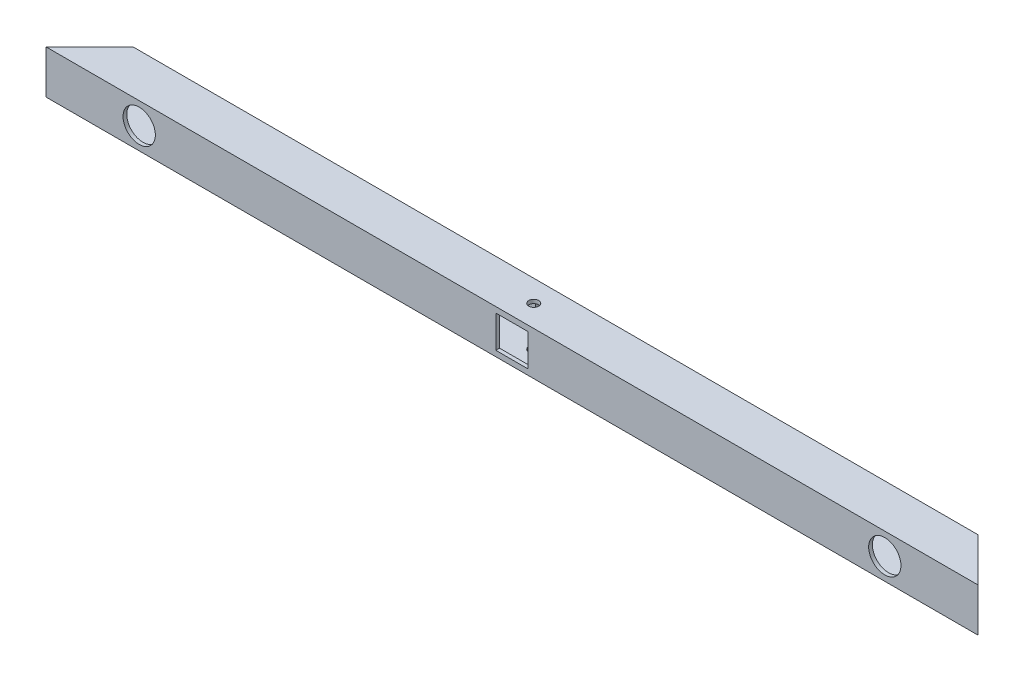
ISO-10303-21;
HEADER;
FILE_DESCRIPTION(('STEP AP214'),'2;1');
FILE_NAME('part.step','',(''),(''),'','','');
FILE_SCHEMA(('AUTOMOTIVE_DESIGN { 1 0 10303 214 1 1 1 1 }'));
ENDSEC;
DATA;
#1=APPLICATION_CONTEXT('core data for automotive mechanical design processes');
#2=APPLICATION_PROTOCOL_DEFINITION('international standard','automotive_design',2000,#1);
#3=PRODUCT_CONTEXT('',#1,'mechanical');
#4=PRODUCT('Part','Part','',(#3));
#5=PRODUCT_RELATED_PRODUCT_CATEGORY('part','',(#4));
#6=PRODUCT_DEFINITION_FORMATION('','',#4);
#7=PRODUCT_DEFINITION_CONTEXT('part definition',#1,'design');
#8=PRODUCT_DEFINITION('design','',#6,#7);
#9=PRODUCT_DEFINITION_SHAPE('','',#8);
#10=(LENGTH_UNIT() NAMED_UNIT(*) SI_UNIT(.MILLI.,.METRE.));
#11=(NAMED_UNIT(*) PLANE_ANGLE_UNIT() SI_UNIT($,.RADIAN.));
#12=(NAMED_UNIT(*) SI_UNIT($,.STERADIAN.) SOLID_ANGLE_UNIT());
#13=UNCERTAINTY_MEASURE_WITH_UNIT(LENGTH_MEASURE(1.E-05),#10,'distance_accuracy_value','');
#14=(GEOMETRIC_REPRESENTATION_CONTEXT(3) GLOBAL_UNCERTAINTY_ASSIGNED_CONTEXT((#13)) GLOBAL_UNIT_ASSIGNED_CONTEXT((#10,
#11,#12)) REPRESENTATION_CONTEXT('',''));
#15=CARTESIAN_POINT('',(0.,0.,0.));
#16=DIRECTION('',(0.,0.,1.));
#17=DIRECTION('',(1.,0.,0.));
#18=AXIS2_PLACEMENT_3D('',#15,#16,#17);
#19=CARTESIAN_POINT('',(425.,35.,12.5));
#20=DIRECTION('',(-0.707106781186543,0.,0.707106781186552));
#21=DIRECTION('',(0.707106781186552,0.,0.707106781186543));
#22=AXIS2_PLACEMENT_3D('',#19,#20,#21);
#23=PLANE('',#22);
#24=DIRECTION('',(-0.707106781186552,0.,-0.707106781186543));
#25=VECTOR('',#24,1.);
#26=CARTESIAN_POINT('',(425.,0.,12.5));
#27=LINE('',#26,#25);
#28=CARTESIAN_POINT('',(425.,0.,12.5));
#29=VERTEX_POINT('',#28);
#30=CARTESIAN_POINT('',(390.,0.,-22.5));
#31=VERTEX_POINT('',#30);
#32=EDGE_CURVE('E249',#29,#31,#27,.T.);
#33=ORIENTED_EDGE('',*,*,#32,.T.);
#34=DIRECTION('',(0.,-1.,0.));
#35=VECTOR('',#34,1.);
#36=CARTESIAN_POINT('',(390.,35.,-22.5));
#37=LINE('',#36,#35);
#38=CARTESIAN_POINT('',(390.,35.,-22.5));
#39=VERTEX_POINT('',#38);
#40=EDGE_CURVE('E282',#39,#31,#37,.T.);
#41=ORIENTED_EDGE('',*,*,#40,.F.);
#42=DIRECTION('',(-0.707106781186552,0.,-0.707106781186543));
#43=VECTOR('',#42,1.);
#44=CARTESIAN_POINT('',(425.,35.,12.5));
#45=LINE('',#44,#43);
#46=CARTESIAN_POINT('',(425.,35.,12.5));
#47=VERTEX_POINT('',#46);
#48=EDGE_CURVE('E256',#47,#39,#45,.T.);
#49=ORIENTED_EDGE('',*,*,#48,.F.);
#50=DIRECTION('',(0.,-1.,0.));
#51=VECTOR('',#50,1.);
#52=CARTESIAN_POINT('',(425.,35.,12.5));
#53=LINE('',#52,#51);
#54=EDGE_CURVE('E266',#47,#29,#53,.T.);
#55=ORIENTED_EDGE('',*,*,#54,.T.);
#56=EDGE_LOOP('',(#33,#41,#49,#55));
#57=FACE_BOUND('',#56,.T.);
#58=DIRECTION('',(-0.707106781186552,0.,-0.707106781186543));
#59=VECTOR('',#58,1.);
#60=CARTESIAN_POINT('',(206.249999999998,3.,-206.25));
#61=LINE('',#60,#59);
#62=CARTESIAN_POINT('',(422.,3.,9.50000000000001));
#63=VERTEX_POINT('',#62);
#64=CARTESIAN_POINT('',(393.,3.,-19.5));
#65=VERTEX_POINT('',#64);
#66=EDGE_CURVE('E222',#63,#65,#61,.T.);
#67=ORIENTED_EDGE('',*,*,#66,.F.);
#68=DIRECTION('',(0.,-1.,0.));
#69=VECTOR('',#68,1.);
#70=CARTESIAN_POINT('',(422.,35.,9.50000000000001));
#71=LINE('',#70,#69);
#72=CARTESIAN_POINT('',(422.,32.,9.50000000000001));
#73=VERTEX_POINT('',#72);
#74=EDGE_CURVE('E234',#73,#63,#71,.T.);
#75=ORIENTED_EDGE('',*,*,#74,.F.);
#76=DIRECTION('',(-0.707106781186552,0.,-0.707106781186543));
#77=VECTOR('',#76,1.);
#78=CARTESIAN_POINT('',(206.249999999998,32.,-206.25));
#79=LINE('',#78,#77);
#80=CARTESIAN_POINT('',(393.,32.,-19.5));
#81=VERTEX_POINT('',#80);
#82=EDGE_CURVE('E230',#73,#81,#79,.T.);
#83=ORIENTED_EDGE('',*,*,#82,.T.);
#84=DIRECTION('',(0.,-1.,0.));
#85=VECTOR('',#84,1.);
#86=CARTESIAN_POINT('',(393.,35.,-19.5));
#87=LINE('',#86,#85);
#88=EDGE_CURVE('E240',#81,#65,#87,.T.);
#89=ORIENTED_EDGE('',*,*,#88,.T.);
#90=EDGE_LOOP('',(#67,#75,#83,#89));
#91=FACE_BOUND('',#90,.T.);
#92=ADVANCED_FACE('F35',(#57,#91),#23,.F.);
#93=CARTESIAN_POINT('',(-325.,35.,12.5));
#94=DIRECTION('',(0.707106781186549,0.,0.707106781186546));
#95=DIRECTION('',(0.707106781186546,0.,-0.707106781186549));
#96=AXIS2_PLACEMENT_3D('',#93,#94,#95);
#97=PLANE('',#96);
#98=DIRECTION('',(-0.707106781186546,0.,0.707106781186549));
#99=VECTOR('',#98,1.);
#100=CARTESIAN_POINT('',(-325.,0.,12.5));
#101=LINE('',#100,#99);
#102=CARTESIAN_POINT('',(-290.,0.,-22.5));
#103=VERTEX_POINT('',#102);
#104=CARTESIAN_POINT('',(-325.,0.,12.5));
#105=VERTEX_POINT('',#104);
#106=EDGE_CURVE('E271',#103,#105,#101,.T.);
#107=ORIENTED_EDGE('',*,*,#106,.T.);
#108=DIRECTION('',(0.,-1.,0.));
#109=VECTOR('',#108,1.);
#110=CARTESIAN_POINT('',(-325.,35.,12.5));
#111=LINE('',#110,#109);
#112=CARTESIAN_POINT('',(-325.,35.,12.5));
#113=VERTEX_POINT('',#112);
#114=EDGE_CURVE('E276',#113,#105,#111,.T.);
#115=ORIENTED_EDGE('',*,*,#114,.F.);
#116=DIRECTION('',(-0.707106781186546,0.,0.707106781186549));
#117=VECTOR('',#116,1.);
#118=CARTESIAN_POINT('',(-325.,35.,12.5));
#119=LINE('',#118,#117);
#120=CARTESIAN_POINT('',(-290.,35.,-22.5));
#121=VERTEX_POINT('',#120);
#122=EDGE_CURVE('E262',#121,#113,#119,.T.);
#123=ORIENTED_EDGE('',*,*,#122,.F.);
#124=DIRECTION('',(0.,-1.,0.));
#125=VECTOR('',#124,1.);
#126=CARTESIAN_POINT('',(-290.,35.,-22.5));
#127=LINE('',#126,#125);
#128=EDGE_CURVE('E279',#121,#103,#127,.T.);
#129=ORIENTED_EDGE('',*,*,#128,.T.);
#130=EDGE_LOOP('',(#107,#115,#123,#129));
#131=FACE_BOUND('',#130,.T.);
#132=DIRECTION('',(-0.707106781186546,0.,0.707106781186549));
#133=VECTOR('',#132,1.);
#134=CARTESIAN_POINT('',(-156.250000000001,3.,-156.25));
#135=LINE('',#134,#133);
#136=CARTESIAN_POINT('',(-293.,3.,-19.5));
#137=VERTEX_POINT('',#136);
#138=CARTESIAN_POINT('',(-322.,3.,9.50000000000001));
#139=VERTEX_POINT('',#138);
#140=EDGE_CURVE('E225',#137,#139,#135,.T.);
#141=ORIENTED_EDGE('',*,*,#140,.F.);
#142=DIRECTION('',(0.,-1.,0.));
#143=VECTOR('',#142,1.);
#144=CARTESIAN_POINT('',(-293.,35.,-19.5));
#145=LINE('',#144,#143);
#146=CARTESIAN_POINT('',(-293.,32.,-19.5));
#147=VERTEX_POINT('',#146);
#148=EDGE_CURVE('E237',#147,#137,#145,.T.);
#149=ORIENTED_EDGE('',*,*,#148,.F.);
#150=DIRECTION('',(-0.707106781186546,0.,0.707106781186549));
#151=VECTOR('',#150,1.);
#152=CARTESIAN_POINT('',(-156.250000000001,32.,-156.25));
#153=LINE('',#152,#151);
#154=CARTESIAN_POINT('',(-322.,32.,9.50000000000001));
#155=VERTEX_POINT('',#154);
#156=EDGE_CURVE('E229',#147,#155,#153,.T.);
#157=ORIENTED_EDGE('',*,*,#156,.T.);
#158=DIRECTION('',(0.,-1.,0.));
#159=VECTOR('',#158,1.);
#160=CARTESIAN_POINT('',(-322.,35.,9.50000000000001));
#161=LINE('',#160,#159);
#162=EDGE_CURVE('E241',#155,#139,#161,.T.);
#163=ORIENTED_EDGE('',*,*,#162,.T.);
#164=EDGE_LOOP('',(#141,#149,#157,#163));
#165=FACE_BOUND('',#164,.T.);
#166=ADVANCED_FACE('F339',(#131,#165),#97,.F.);
#167=CARTESIAN_POINT('',(-290.,35.,-22.5));
#168=DIRECTION('',(0.,0.,1.));
#169=DIRECTION('',(1.,0.,0.));
#170=AXIS2_PLACEMENT_3D('',#167,#168,#169);
#171=PLANE('',#170);
#172=DIRECTION('',(1.,0.,0.));
#173=VECTOR('',#172,1.);
#174=CARTESIAN_POINT('',(62.9999999999999,30.5000000000001,-22.5));
#175=LINE('',#174,#173);
#176=CARTESIAN_POINT('',(36.9999999999999,30.5000000000001,-22.5));
#177=VERTEX_POINT('',#176);
#178=CARTESIAN_POINT('',(62.9999999999999,30.5000000000001,-22.5));
#179=VERTEX_POINT('',#178);
#180=EDGE_CURVE('E163',#177,#179,#175,.T.);
#181=ORIENTED_EDGE('',*,*,#180,.F.);
#182=DIRECTION('',(0.,1.,0.));
#183=VECTOR('',#182,1.);
#184=CARTESIAN_POINT('',(36.9999999999999,30.5000000000001,-22.5));
#185=LINE('',#184,#183);
#186=CARTESIAN_POINT('',(36.9999999999999,4.5000000000001,-22.5));
#187=VERTEX_POINT('',#186);
#188=EDGE_CURVE('E50',#187,#177,#185,.T.);
#189=ORIENTED_EDGE('',*,*,#188,.F.);
#190=DIRECTION('',(-1.,0.,0.));
#191=VECTOR('',#190,1.);
#192=CARTESIAN_POINT('',(62.9999999999999,4.5000000000001,-22.5));
#193=LINE('',#192,#191);
#194=CARTESIAN_POINT('',(62.9999999999999,4.5000000000001,-22.5));
#195=VERTEX_POINT('',#194);
#196=EDGE_CURVE('E171',#195,#187,#193,.T.);
#197=ORIENTED_EDGE('',*,*,#196,.F.);
#198=DIRECTION('',(0.,-1.,0.));
#199=VECTOR('',#198,1.);
#200=CARTESIAN_POINT('',(62.9999999999999,30.5000000000001,-22.5));
#201=LINE('',#200,#199);
#202=EDGE_CURVE('E154',#179,#195,#201,.T.);
#203=ORIENTED_EDGE('',*,*,#202,.F.);
#204=EDGE_LOOP('',(#181,#189,#197,#203));
#205=FACE_BOUND('',#204,.T.);
#206=CARTESIAN_POINT('',(-250.,17.5,-22.5));
#207=DIRECTION('',(0.,0.,1.));
#208=DIRECTION('',(1.,0.,0.));
#209=AXIS2_PLACEMENT_3D('',#206,#207,#208);
#210=CIRCLE('',#209,13.);
#211=CARTESIAN_POINT('',(-237.,17.5,-22.5));
#212=VERTEX_POINT('',#211);
#213=EDGE_CURVE('E219',#212,#212,#210,.T.);
#214=ORIENTED_EDGE('',*,*,#213,.T.);
#215=EDGE_LOOP('',(#214));
#216=FACE_BOUND('',#215,.T.);
#217=CARTESIAN_POINT('',(350.,17.5,-22.5));
#218=DIRECTION('',(0.,0.,1.));
#219=DIRECTION('',(1.,0.,0.));
#220=AXIS2_PLACEMENT_3D('',#217,#218,#219);
#221=CIRCLE('',#220,13.);
#222=CARTESIAN_POINT('',(363.,17.5,-22.5));
#223=VERTEX_POINT('',#222);
#224=EDGE_CURVE('E212',#223,#223,#221,.T.);
#225=ORIENTED_EDGE('',*,*,#224,.T.);
#226=EDGE_LOOP('',(#225));
#227=FACE_BOUND('',#226,.T.);
#228=DIRECTION('',(-1.,0.,0.));
#229=VECTOR('',#228,1.);
#230=CARTESIAN_POINT('',(-290.,0.,-22.5));
#231=LINE('',#230,#229);
#232=EDGE_CURVE('E269',#31,#103,#231,.T.);
#233=ORIENTED_EDGE('',*,*,#232,.T.);
#234=ORIENTED_EDGE('',*,*,#128,.F.);
#235=DIRECTION('',(-1.,0.,0.));
#236=VECTOR('',#235,1.);
#237=CARTESIAN_POINT('',(-290.,35.,-22.5));
#238=LINE('',#237,#236);
#239=EDGE_CURVE('E259',#39,#121,#238,.T.);
#240=ORIENTED_EDGE('',*,*,#239,.F.);
#241=ORIENTED_EDGE('',*,*,#40,.T.);
#242=EDGE_LOOP('',(#233,#234,#240,#241));
#243=FACE_BOUND('',#242,.T.);
#244=ADVANCED_FACE('F168',(#205,#216,#227,#243),#171,.F.);
#245=CARTESIAN_POINT('',(-325.,35.,12.5));
#246=DIRECTION('',(0.,0.,-1.));
#247=DIRECTION('',(-1.,0.,0.));
#248=AXIS2_PLACEMENT_3D('',#245,#246,#247);
#249=PLANE('',#248);
#250=DIRECTION('',(-1.,0.,0.));
#251=VECTOR('',#250,1.);
#252=CARTESIAN_POINT('',(-325.,4.5000000000001,12.5));
#253=LINE('',#252,#251);
#254=CARTESIAN_POINT('',(62.9999999999999,4.5000000000001,12.5));
#255=VERTEX_POINT('',#254);
#256=CARTESIAN_POINT('',(36.9999999999999,4.5000000000001,12.5));
#257=VERTEX_POINT('',#256);
#258=EDGE_CURVE('E194',#255,#257,#253,.T.);
#259=ORIENTED_EDGE('',*,*,#258,.T.);
#260=DIRECTION('',(0.,1.,0.));
#261=VECTOR('',#260,1.);
#262=CARTESIAN_POINT('',(36.9999999999999,35.,12.5));
#263=LINE('',#262,#261);
#264=CARTESIAN_POINT('',(36.9999999999999,30.5000000000001,12.5));
#265=VERTEX_POINT('',#264);
#266=EDGE_CURVE('E199',#257,#265,#263,.T.);
#267=ORIENTED_EDGE('',*,*,#266,.T.);
#268=DIRECTION('',(1.,0.,0.));
#269=VECTOR('',#268,1.);
#270=CARTESIAN_POINT('',(-325.,30.5000000000001,12.5));
#271=LINE('',#270,#269);
#272=CARTESIAN_POINT('',(62.9999999999999,30.5000000000001,12.5));
#273=VERTEX_POINT('',#272);
#274=EDGE_CURVE('E185',#265,#273,#271,.T.);
#275=ORIENTED_EDGE('',*,*,#274,.T.);
#276=DIRECTION('',(0.,-1.,0.));
#277=VECTOR('',#276,1.);
#278=CARTESIAN_POINT('',(62.9999999999999,35.,12.5));
#279=LINE('',#278,#277);
#280=EDGE_CURVE('E189',#273,#255,#279,.T.);
#281=ORIENTED_EDGE('',*,*,#280,.T.);
#282=EDGE_LOOP('',(#259,#267,#275,#281));
#283=FACE_BOUND('',#282,.T.);
#284=CARTESIAN_POINT('',(-250.,17.5,12.5));
#285=DIRECTION('',(0.,0.,1.));
#286=DIRECTION('',(1.,0.,0.));
#287=AXIS2_PLACEMENT_3D('',#284,#285,#286);
#288=CIRCLE('',#287,13.);
#289=CARTESIAN_POINT('',(-237.,17.5,12.5));
#290=VERTEX_POINT('',#289);
#291=EDGE_CURVE('E203',#290,#290,#288,.T.);
#292=ORIENTED_EDGE('',*,*,#291,.F.);
#293=EDGE_LOOP('',(#292));
#294=FACE_BOUND('',#293,.T.);
#295=CARTESIAN_POINT('',(350.,17.5,12.5));
#296=DIRECTION('',(0.,0.,1.));
#297=DIRECTION('',(1.,0.,0.));
#298=AXIS2_PLACEMENT_3D('',#295,#296,#297);
#299=CIRCLE('',#298,13.);
#300=CARTESIAN_POINT('',(363.,17.5,12.5));
#301=VERTEX_POINT('',#300);
#302=EDGE_CURVE('E202',#301,#301,#299,.T.);
#303=ORIENTED_EDGE('',*,*,#302,.F.);
#304=EDGE_LOOP('',(#303));
#305=FACE_BOUND('',#304,.T.);
#306=DIRECTION('',(1.,0.,0.));
#307=VECTOR('',#306,1.);
#308=CARTESIAN_POINT('',(-325.,0.,12.5));
#309=LINE('',#308,#307);
#310=EDGE_CURVE('E260',#105,#29,#309,.T.);
#311=ORIENTED_EDGE('',*,*,#310,.T.);
#312=ORIENTED_EDGE('',*,*,#54,.F.);
#313=DIRECTION('',(1.,0.,0.));
#314=VECTOR('',#313,1.);
#315=CARTESIAN_POINT('',(-325.,35.,12.5));
#316=LINE('',#315,#314);
#317=EDGE_CURVE('E264',#113,#47,#316,.T.);
#318=ORIENTED_EDGE('',*,*,#317,.F.);
#319=ORIENTED_EDGE('',*,*,#114,.T.);
#320=EDGE_LOOP('',(#311,#312,#318,#319));
#321=FACE_BOUND('',#320,.T.);
#322=ADVANCED_FACE('F313',(#283,#294,#305,#321),#249,.F.);
#323=CARTESIAN_POINT('',(0.,35.,0.));
#324=DIRECTION('',(0.,-1.,0.));
#325=DIRECTION('',(0.,0.,-1.));
#326=AXIS2_PLACEMENT_3D('',#323,#324,#325);
#327=PLANE('',#326);
#328=CARTESIAN_POINT('',(50.0000000000002,35.,-5.));
#329=DIRECTION('',(0.,1.,0.));
#330=DIRECTION('',(0.,0.,1.));
#331=AXIS2_PLACEMENT_3D('',#328,#329,#330);
#332=CIRCLE('',#331,4.00000000000001);
#333=CARTESIAN_POINT('',(50.0000000000002,35.,-0.999999999999991));
#334=VERTEX_POINT('',#333);
#335=EDGE_CURVE('E562',#334,#334,#332,.T.);
#336=ORIENTED_EDGE('',*,*,#335,.F.);
#337=EDGE_LOOP('',(#336));
#338=FACE_BOUND('',#337,.T.);
#339=ORIENTED_EDGE('',*,*,#48,.T.);
#340=ORIENTED_EDGE('',*,*,#239,.T.);
#341=ORIENTED_EDGE('',*,*,#122,.T.);
#342=ORIENTED_EDGE('',*,*,#317,.T.);
#343=EDGE_LOOP('',(#339,#340,#341,#342));
#344=FACE_BOUND('',#343,.T.);
#345=ADVANCED_FACE('F316',(#338,#344),#327,.F.);
#346=CARTESIAN_POINT('',(0.,0.,0.));
#347=DIRECTION('',(0.,-1.,0.));
#348=DIRECTION('',(0.,0.,-1.));
#349=AXIS2_PLACEMENT_3D('',#346,#347,#348);
#350=PLANE('',#349);
#351=CARTESIAN_POINT('',(50.0000000000002,0.,-5.));
#352=DIRECTION('',(0.,1.,0.));
#353=DIRECTION('',(0.,0.,1.));
#354=AXIS2_PLACEMENT_3D('',#351,#352,#353);
#355=CIRCLE('',#354,4.00000000000001);
#356=CARTESIAN_POINT('',(50.0000000000002,0.,-0.999999999999991));
#357=VERTEX_POINT('',#356);
#358=EDGE_CURVE('E563',#357,#357,#355,.T.);
#359=ORIENTED_EDGE('',*,*,#358,.T.);
#360=EDGE_LOOP('',(#359));
#361=FACE_BOUND('',#360,.T.);
#362=ORIENTED_EDGE('',*,*,#32,.F.);
#363=ORIENTED_EDGE('',*,*,#310,.F.);
#364=ORIENTED_EDGE('',*,*,#106,.F.);
#365=ORIENTED_EDGE('',*,*,#232,.F.);
#366=EDGE_LOOP('',(#362,#363,#364,#365));
#367=FACE_BOUND('',#366,.T.);
#368=ADVANCED_FACE('F333',(#361,#367),#350,.T.);
#369=CARTESIAN_POINT('',(-290.,35.,-19.5));
#370=DIRECTION('',(0.,0.,1.));
#371=DIRECTION('',(1.,0.,0.));
#372=AXIS2_PLACEMENT_3D('',#369,#370,#371);
#373=PLANE('',#372);
#374=DIRECTION('',(0.,-1.,0.));
#375=VECTOR('',#374,1.);
#376=CARTESIAN_POINT('',(36.9999999999999,35.,-19.5));
#377=LINE('',#376,#375);
#378=CARTESIAN_POINT('',(36.9999999999999,30.5000000000001,-19.5));
#379=VERTEX_POINT('',#378);
#380=CARTESIAN_POINT('',(36.9999999999999,4.5000000000001,-19.5));
#381=VERTEX_POINT('',#380);
#382=EDGE_CURVE('E197',#379,#381,#377,.T.);
#383=ORIENTED_EDGE('',*,*,#382,.F.);
#384=DIRECTION('',(-1.,0.,0.));
#385=VECTOR('',#384,1.);
#386=CARTESIAN_POINT('',(-290.,30.5000000000001,-19.5));
#387=LINE('',#386,#385);
#388=CARTESIAN_POINT('',(62.9999999999999,30.5000000000001,-19.5));
#389=VERTEX_POINT('',#388);
#390=EDGE_CURVE('E183',#389,#379,#387,.T.);
#391=ORIENTED_EDGE('',*,*,#390,.F.);
#392=DIRECTION('',(0.,1.,0.));
#393=VECTOR('',#392,1.);
#394=CARTESIAN_POINT('',(62.9999999999999,35.,-19.5));
#395=LINE('',#394,#393);
#396=CARTESIAN_POINT('',(62.9999999999999,4.5000000000001,-19.5));
#397=VERTEX_POINT('',#396);
#398=EDGE_CURVE('E157',#397,#389,#395,.T.);
#399=ORIENTED_EDGE('',*,*,#398,.F.);
#400=DIRECTION('',(1.,0.,0.));
#401=VECTOR('',#400,1.);
#402=CARTESIAN_POINT('',(-290.,4.5000000000001,-19.5));
#403=LINE('',#402,#401);
#404=EDGE_CURVE('E192',#381,#397,#403,.T.);
#405=ORIENTED_EDGE('',*,*,#404,.F.);
#406=EDGE_LOOP('',(#383,#391,#399,#405));
#407=FACE_BOUND('',#406,.T.);
#408=CARTESIAN_POINT('',(-250.,17.5,-19.5));
#409=DIRECTION('',(0.,0.,1.));
#410=DIRECTION('',(1.,0.,0.));
#411=AXIS2_PLACEMENT_3D('',#408,#409,#410);
#412=CIRCLE('',#411,13.);
#413=CARTESIAN_POINT('',(-237.,17.5,-19.5));
#414=VERTEX_POINT('',#413);
#415=EDGE_CURVE('E216',#414,#414,#412,.T.);
#416=ORIENTED_EDGE('',*,*,#415,.F.);
#417=EDGE_LOOP('',(#416));
#418=FACE_BOUND('',#417,.T.);
#419=CARTESIAN_POINT('',(350.,17.5,-19.5));
#420=DIRECTION('',(0.,0.,1.));
#421=DIRECTION('',(1.,0.,0.));
#422=AXIS2_PLACEMENT_3D('',#419,#420,#421);
#423=CIRCLE('',#422,13.);
#424=CARTESIAN_POINT('',(363.,17.5,-19.5));
#425=VERTEX_POINT('',#424);
#426=EDGE_CURVE('E209',#425,#425,#423,.T.);
#427=ORIENTED_EDGE('',*,*,#426,.F.);
#428=EDGE_LOOP('',(#427));
#429=FACE_BOUND('',#428,.T.);
#430=DIRECTION('',(-1.,0.,0.));
#431=VECTOR('',#430,1.);
#432=CARTESIAN_POINT('',(0.,3.,-19.5));
#433=LINE('',#432,#431);
#434=EDGE_CURVE('E223',#65,#137,#433,.T.);
#435=ORIENTED_EDGE('',*,*,#434,.F.);
#436=ORIENTED_EDGE('',*,*,#88,.F.);
#437=DIRECTION('',(-1.,0.,0.));
#438=VECTOR('',#437,1.);
#439=CARTESIAN_POINT('',(0.,32.,-19.5));
#440=LINE('',#439,#438);
#441=EDGE_CURVE('E226',#81,#147,#440,.T.);
#442=ORIENTED_EDGE('',*,*,#441,.T.);
#443=ORIENTED_EDGE('',*,*,#148,.T.);
#444=EDGE_LOOP('',(#435,#436,#442,#443));
#445=FACE_BOUND('',#444,.T.);
#446=ADVANCED_FACE('F354',(#407,#418,#429,#445),#373,.T.);
#447=CARTESIAN_POINT('',(-325.,35.,9.50000000000001));
#448=DIRECTION('',(0.,0.,-1.));
#449=DIRECTION('',(-1.,0.,0.));
#450=AXIS2_PLACEMENT_3D('',#447,#448,#449);
#451=PLANE('',#450);
#452=DIRECTION('',(0.,1.,0.));
#453=VECTOR('',#452,1.);
#454=CARTESIAN_POINT('',(36.9999999999999,35.,9.50000000000001));
#455=LINE('',#454,#453);
#456=CARTESIAN_POINT('',(36.9999999999999,4.5000000000001,9.50000000000001));
#457=VERTEX_POINT('',#456);
#458=CARTESIAN_POINT('',(36.9999999999999,30.5000000000001,9.50000000000001));
#459=VERTEX_POINT('',#458);
#460=EDGE_CURVE('E11',#457,#459,#455,.T.);
#461=ORIENTED_EDGE('',*,*,#460,.F.);
#462=DIRECTION('',(-1.,0.,0.));
#463=VECTOR('',#462,1.);
#464=CARTESIAN_POINT('',(-325.,4.5000000000001,9.50000000000001));
#465=LINE('',#464,#463);
#466=CARTESIAN_POINT('',(62.9999999999999,4.5000000000001,9.50000000000001));
#467=VERTEX_POINT('',#466);
#468=EDGE_CURVE('E43',#467,#457,#465,.T.);
#469=ORIENTED_EDGE('',*,*,#468,.F.);
#470=DIRECTION('',(0.,-1.,0.));
#471=VECTOR('',#470,1.);
#472=CARTESIAN_POINT('',(62.9999999999999,35.,9.50000000000001));
#473=LINE('',#472,#471);
#474=CARTESIAN_POINT('',(62.9999999999999,30.5000000000001,9.50000000000001));
#475=VERTEX_POINT('',#474);
#476=EDGE_CURVE('E291',#475,#467,#473,.T.);
#477=ORIENTED_EDGE('',*,*,#476,.F.);
#478=DIRECTION('',(1.,0.,0.));
#479=VECTOR('',#478,1.);
#480=CARTESIAN_POINT('',(-325.,30.5000000000001,9.50000000000001));
#481=LINE('',#480,#479);
#482=EDGE_CURVE('E285',#459,#475,#481,.T.);
#483=ORIENTED_EDGE('',*,*,#482,.F.);
#484=EDGE_LOOP('',(#461,#469,#477,#483));
#485=FACE_BOUND('',#484,.T.);
#486=CARTESIAN_POINT('',(-250.,17.5,9.5));
#487=DIRECTION('',(0.,0.,-1.));
#488=DIRECTION('',(-1.,0.,0.));
#489=AXIS2_PLACEMENT_3D('',#486,#487,#488);
#490=CIRCLE('',#489,13.);
#491=CARTESIAN_POINT('',(-263.,17.5,9.5));
#492=VERTEX_POINT('',#491);
#493=EDGE_CURVE('E215',#492,#492,#490,.T.);
#494=ORIENTED_EDGE('',*,*,#493,.F.);
#495=EDGE_LOOP('',(#494));
#496=FACE_BOUND('',#495,.T.);
#497=CARTESIAN_POINT('',(350.,17.5,9.5));
#498=DIRECTION('',(0.,0.,-1.));
#499=DIRECTION('',(-1.,0.,0.));
#500=AXIS2_PLACEMENT_3D('',#497,#498,#499);
#501=CIRCLE('',#500,13.);
#502=CARTESIAN_POINT('',(337.,17.5,9.5));
#503=VERTEX_POINT('',#502);
#504=EDGE_CURVE('E206',#503,#503,#501,.T.);
#505=ORIENTED_EDGE('',*,*,#504,.F.);
#506=EDGE_LOOP('',(#505));
#507=FACE_BOUND('',#506,.T.);
#508=DIRECTION('',(1.,0.,0.));
#509=VECTOR('',#508,1.);
#510=CARTESIAN_POINT('',(0.,3.,9.50000000000001));
#511=LINE('',#510,#509);
#512=EDGE_CURVE('E235',#139,#63,#511,.T.);
#513=ORIENTED_EDGE('',*,*,#512,.F.);
#514=ORIENTED_EDGE('',*,*,#162,.F.);
#515=DIRECTION('',(1.,0.,0.));
#516=VECTOR('',#515,1.);
#517=CARTESIAN_POINT('',(0.,32.,9.50000000000001));
#518=LINE('',#517,#516);
#519=EDGE_CURVE('E231',#155,#73,#518,.T.);
#520=ORIENTED_EDGE('',*,*,#519,.T.);
#521=ORIENTED_EDGE('',*,*,#74,.T.);
#522=EDGE_LOOP('',(#513,#514,#520,#521));
#523=FACE_BOUND('',#522,.T.);
#524=ADVANCED_FACE('F307',(#485,#496,#507,#523),#451,.T.);
#525=CARTESIAN_POINT('',(0.,32.,0.));
#526=DIRECTION('',(0.,-1.,0.));
#527=DIRECTION('',(0.,0.,-1.));
#528=AXIS2_PLACEMENT_3D('',#525,#526,#527);
#529=PLANE('',#528);
#530=CARTESIAN_POINT('',(50.0000000000002,32.,-5.));
#531=DIRECTION('',(0.,-1.,0.));
#532=DIRECTION('',(0.,0.,-1.));
#533=AXIS2_PLACEMENT_3D('',#530,#531,#532);
#534=CIRCLE('',#533,4.00000000000001);
#535=CARTESIAN_POINT('',(50.0000000000002,32.,-9.00000000000001));
#536=VERTEX_POINT('',#535);
#537=EDGE_CURVE('E559',#536,#536,#534,.T.);
#538=ORIENTED_EDGE('',*,*,#537,.F.);
#539=EDGE_LOOP('',(#538));
#540=FACE_BOUND('',#539,.T.);
#541=ORIENTED_EDGE('',*,*,#82,.F.);
#542=ORIENTED_EDGE('',*,*,#519,.F.);
#543=ORIENTED_EDGE('',*,*,#156,.F.);
#544=ORIENTED_EDGE('',*,*,#441,.F.);
#545=EDGE_LOOP('',(#541,#542,#543,#544));
#546=FACE_BOUND('',#545,.T.);
#547=ADVANCED_FACE('F356',(#540,#546),#529,.T.);
#548=CARTESIAN_POINT('',(0.,3.,0.));
#549=DIRECTION('',(0.,-1.,0.));
#550=DIRECTION('',(0.,0.,-1.));
#551=AXIS2_PLACEMENT_3D('',#548,#549,#550);
#552=PLANE('',#551);
#553=CARTESIAN_POINT('',(50.0000000000002,3.,-5.));
#554=DIRECTION('',(0.,-1.,0.));
#555=DIRECTION('',(0.,0.,-1.));
#556=AXIS2_PLACEMENT_3D('',#553,#554,#555);
#557=CIRCLE('',#556,4.00000000000001);
#558=CARTESIAN_POINT('',(50.0000000000002,3.,-9.00000000000001));
#559=VERTEX_POINT('',#558);
#560=EDGE_CURVE('E38',#559,#559,#557,.T.);
#561=ORIENTED_EDGE('',*,*,#560,.T.);
#562=EDGE_LOOP('',(#561));
#563=FACE_BOUND('',#562,.T.);
#564=ORIENTED_EDGE('',*,*,#66,.T.);
#565=ORIENTED_EDGE('',*,*,#434,.T.);
#566=ORIENTED_EDGE('',*,*,#140,.T.);
#567=ORIENTED_EDGE('',*,*,#512,.T.);
#568=EDGE_LOOP('',(#564,#565,#566,#567));
#569=FACE_BOUND('',#568,.T.);
#570=ADVANCED_FACE('F347',(#563,#569),#552,.F.);
#571=CARTESIAN_POINT('',(350.,17.5,-36.5));
#572=DIRECTION('',(0.,0.,1.));
#573=DIRECTION('',(1.,0.,0.));
#574=AXIS2_PLACEMENT_3D('',#571,#572,#573);
#575=CYLINDRICAL_SURFACE('',#574,13.);
#576=ORIENTED_EDGE('',*,*,#504,.T.);
#577=EDGE_LOOP('',(#576));
#578=FACE_BOUND('',#577,.T.);
#579=ORIENTED_EDGE('',*,*,#302,.T.);
#580=EDGE_LOOP('',(#579));
#581=FACE_BOUND('',#580,.T.);
#582=ADVANCED_FACE('F364',(#578,#581),#575,.F.);
#583=CARTESIAN_POINT('',(-250.,17.5,-36.5));
#584=DIRECTION('',(0.,0.,1.));
#585=DIRECTION('',(1.,0.,0.));
#586=AXIS2_PLACEMENT_3D('',#583,#584,#585);
#587=CYLINDRICAL_SURFACE('',#586,13.);
#588=ORIENTED_EDGE('',*,*,#493,.T.);
#589=EDGE_LOOP('',(#588));
#590=FACE_BOUND('',#589,.T.);
#591=ORIENTED_EDGE('',*,*,#291,.T.);
#592=EDGE_LOOP('',(#591));
#593=FACE_BOUND('',#592,.T.);
#594=ADVANCED_FACE('F506',(#590,#593),#587,.F.);
#595=ORIENTED_EDGE('',*,*,#426,.T.);
#596=EDGE_LOOP('',(#595));
#597=FACE_BOUND('',#596,.T.);
#598=ORIENTED_EDGE('',*,*,#224,.F.);
#599=EDGE_LOOP('',(#598));
#600=FACE_BOUND('',#599,.T.);
#601=ADVANCED_FACE('F509',(#597,#600),#575,.F.);
#602=ORIENTED_EDGE('',*,*,#415,.T.);
#603=EDGE_LOOP('',(#602));
#604=FACE_BOUND('',#603,.T.);
#605=ORIENTED_EDGE('',*,*,#213,.F.);
#606=EDGE_LOOP('',(#605));
#607=FACE_BOUND('',#606,.T.);
#608=ADVANCED_FACE('F423',(#604,#607),#587,.F.);
#609=CARTESIAN_POINT('',(62.9999999999999,30.5000000000001,16.5));
#610=DIRECTION('',(0.,1.,0.));
#611=DIRECTION('',(0.,0.,1.));
#612=AXIS2_PLACEMENT_3D('',#609,#610,#611);
#613=PLANE('',#612);
#614=DIRECTION('',(0.,0.,-1.));
#615=VECTOR('',#614,1.);
#616=CARTESIAN_POINT('',(36.9999999999999,30.5000000000001,16.5));
#617=LINE('',#616,#615);
#618=EDGE_CURVE('E160',#265,#459,#617,.T.);
#619=ORIENTED_EDGE('',*,*,#618,.T.);
#620=ORIENTED_EDGE('',*,*,#482,.T.);
#621=DIRECTION('',(0.,0.,-1.));
#622=VECTOR('',#621,1.);
#623=CARTESIAN_POINT('',(62.9999999999999,30.5000000000001,16.5));
#624=LINE('',#623,#622);
#625=EDGE_CURVE('E58',#273,#475,#624,.T.);
#626=ORIENTED_EDGE('',*,*,#625,.F.);
#627=ORIENTED_EDGE('',*,*,#274,.F.);
#628=EDGE_LOOP('',(#619,#620,#626,#627));
#629=FACE_BOUND('',#628,.T.);
#630=ADVANCED_FACE('F309',(#629),#613,.F.);
#631=CARTESIAN_POINT('',(62.9999999999999,30.5000000000001,16.5));
#632=DIRECTION('',(1.,0.,0.));
#633=DIRECTION('',(0.,0.,-1.));
#634=AXIS2_PLACEMENT_3D('',#631,#632,#633);
#635=PLANE('',#634);
#636=ORIENTED_EDGE('',*,*,#625,.T.);
#637=ORIENTED_EDGE('',*,*,#476,.T.);
#638=DIRECTION('',(0.,0.,-1.));
#639=VECTOR('',#638,1.);
#640=CARTESIAN_POINT('',(62.9999999999999,4.5000000000001,16.5));
#641=LINE('',#640,#639);
#642=EDGE_CURVE('E179',#255,#467,#641,.T.);
#643=ORIENTED_EDGE('',*,*,#642,.F.);
#644=ORIENTED_EDGE('',*,*,#280,.F.);
#645=EDGE_LOOP('',(#636,#637,#643,#644));
#646=FACE_BOUND('',#645,.T.);
#647=ADVANCED_FACE('F311',(#646),#635,.F.);
#648=CARTESIAN_POINT('',(62.9999999999999,4.5000000000001,16.5));
#649=DIRECTION('',(0.,-1.,0.));
#650=DIRECTION('',(0.,0.,-1.));
#651=AXIS2_PLACEMENT_3D('',#648,#649,#650);
#652=PLANE('',#651);
#653=ORIENTED_EDGE('',*,*,#642,.T.);
#654=ORIENTED_EDGE('',*,*,#468,.T.);
#655=DIRECTION('',(0.,0.,-1.));
#656=VECTOR('',#655,1.);
#657=CARTESIAN_POINT('',(36.9999999999999,4.5000000000001,16.5));
#658=LINE('',#657,#656);
#659=EDGE_CURVE('E178',#257,#457,#658,.T.);
#660=ORIENTED_EDGE('',*,*,#659,.F.);
#661=ORIENTED_EDGE('',*,*,#258,.F.);
#662=EDGE_LOOP('',(#653,#654,#660,#661));
#663=FACE_BOUND('',#662,.T.);
#664=ADVANCED_FACE('F298',(#663),#652,.F.);
#665=CARTESIAN_POINT('',(36.9999999999999,30.5000000000001,16.5));
#666=DIRECTION('',(-1.,0.,0.));
#667=DIRECTION('',(0.,0.,1.));
#668=AXIS2_PLACEMENT_3D('',#665,#666,#667);
#669=PLANE('',#668);
#670=ORIENTED_EDGE('',*,*,#659,.T.);
#671=ORIENTED_EDGE('',*,*,#460,.T.);
#672=ORIENTED_EDGE('',*,*,#618,.F.);
#673=ORIENTED_EDGE('',*,*,#266,.F.);
#674=EDGE_LOOP('',(#670,#671,#672,#673));
#675=FACE_BOUND('',#674,.T.);
#676=ADVANCED_FACE('F304',(#675),#669,.F.);
#677=ORIENTED_EDGE('',*,*,#382,.T.);
#678=EDGE_CURVE('E176',#381,#187,#658,.T.);
#679=ORIENTED_EDGE('',*,*,#678,.T.);
#680=ORIENTED_EDGE('',*,*,#188,.T.);
#681=EDGE_CURVE('E165',#379,#177,#617,.T.);
#682=ORIENTED_EDGE('',*,*,#681,.F.);
#683=EDGE_LOOP('',(#677,#679,#680,#682));
#684=FACE_BOUND('',#683,.T.);
#685=ADVANCED_FACE('F451',(#684),#669,.F.);
#686=ORIENTED_EDGE('',*,*,#404,.T.);
#687=EDGE_CURVE('E180',#397,#195,#641,.T.);
#688=ORIENTED_EDGE('',*,*,#687,.T.);
#689=ORIENTED_EDGE('',*,*,#196,.T.);
#690=ORIENTED_EDGE('',*,*,#678,.F.);
#691=EDGE_LOOP('',(#686,#688,#689,#690));
#692=FACE_BOUND('',#691,.T.);
#693=ADVANCED_FACE('F443',(#692),#652,.F.);
#694=ORIENTED_EDGE('',*,*,#398,.T.);
#695=EDGE_CURVE('E149',#389,#179,#624,.T.);
#696=ORIENTED_EDGE('',*,*,#695,.T.);
#697=ORIENTED_EDGE('',*,*,#202,.T.);
#698=ORIENTED_EDGE('',*,*,#687,.F.);
#699=EDGE_LOOP('',(#694,#696,#697,#698));
#700=FACE_BOUND('',#699,.T.);
#701=ADVANCED_FACE('F151',(#700),#635,.F.);
#702=ORIENTED_EDGE('',*,*,#390,.T.);
#703=ORIENTED_EDGE('',*,*,#681,.T.);
#704=ORIENTED_EDGE('',*,*,#180,.T.);
#705=ORIENTED_EDGE('',*,*,#695,.F.);
#706=EDGE_LOOP('',(#702,#703,#704,#705));
#707=FACE_BOUND('',#706,.T.);
#708=ADVANCED_FACE('F164',(#707),#613,.F.);
#709=CARTESIAN_POINT('',(50.0000000000002,0.,-5.));
#710=DIRECTION('',(0.,1.,0.));
#711=DIRECTION('',(0.,0.,1.));
#712=AXIS2_PLACEMENT_3D('',#709,#710,#711);
#713=CYLINDRICAL_SURFACE('',#712,4.00000000000001);
#714=ORIENTED_EDGE('',*,*,#358,.F.);
#715=EDGE_LOOP('',(#714));
#716=FACE_BOUND('',#715,.T.);
#717=ORIENTED_EDGE('',*,*,#560,.F.);
#718=EDGE_LOOP('',(#717));
#719=FACE_BOUND('',#718,.T.);
#720=ADVANCED_FACE('F480',(#716,#719),#713,.F.);
#721=ORIENTED_EDGE('',*,*,#537,.T.);
#722=EDGE_LOOP('',(#721));
#723=FACE_BOUND('',#722,.T.);
#724=ORIENTED_EDGE('',*,*,#335,.T.);
#725=EDGE_LOOP('',(#724));
#726=FACE_BOUND('',#725,.T.);
#727=ADVANCED_FACE('F489',(#723,#726),#713,.F.);
#728=CLOSED_SHELL('',(#92,#166,#244,#322,#345,#368,#446,#524,#547,#570,#582,#594,#601,#608,#630,
#647,#664,#676,#685,#693,#701,#708,#720,#727));
#729=MANIFOLD_SOLID_BREP('B2',#728);
#730=ADVANCED_BREP_SHAPE_REPRESENTATION('',(#18,#729),#14);
#731=SHAPE_DEFINITION_REPRESENTATION(#9,#730);
ENDSEC;
END-ISO-10303-21;
